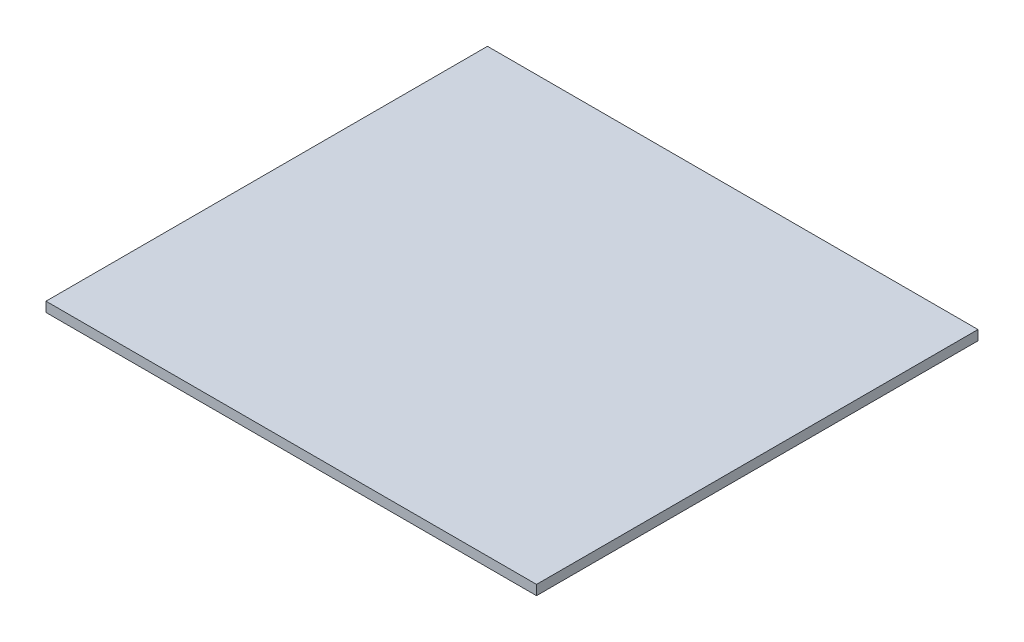
ISO-10303-21;
HEADER;
FILE_DESCRIPTION(('STEP AP214'),'2;1');
FILE_NAME('part.step','',(''),(''),'','','');
FILE_SCHEMA(('AUTOMOTIVE_DESIGN { 1 0 10303 214 1 1 1 1 }'));
ENDSEC;
DATA;
#1=APPLICATION_CONTEXT('core data for automotive mechanical design processes');
#2=APPLICATION_PROTOCOL_DEFINITION('international standard','automotive_design',2000,#1);
#3=PRODUCT_CONTEXT('',#1,'mechanical');
#4=PRODUCT('Part','Part','',(#3));
#5=PRODUCT_RELATED_PRODUCT_CATEGORY('part','',(#4));
#6=PRODUCT_DEFINITION_FORMATION('','',#4);
#7=PRODUCT_DEFINITION_CONTEXT('part definition',#1,'design');
#8=PRODUCT_DEFINITION('design','',#6,#7);
#9=PRODUCT_DEFINITION_SHAPE('','',#8);
#10=(LENGTH_UNIT() NAMED_UNIT(*) SI_UNIT(.MILLI.,.METRE.));
#11=(NAMED_UNIT(*) PLANE_ANGLE_UNIT() SI_UNIT($,.RADIAN.));
#12=(NAMED_UNIT(*) SI_UNIT($,.STERADIAN.) SOLID_ANGLE_UNIT());
#13=UNCERTAINTY_MEASURE_WITH_UNIT(LENGTH_MEASURE(1.E-05),#10,'distance_accuracy_value','');
#14=(GEOMETRIC_REPRESENTATION_CONTEXT(3) GLOBAL_UNCERTAINTY_ASSIGNED_CONTEXT((#13)) GLOBAL_UNIT_ASSIGNED_CONTEXT((#10,
#11,#12)) REPRESENTATION_CONTEXT('',''));
#15=CARTESIAN_POINT('',(0.,0.,0.));
#16=DIRECTION('',(0.,0.,1.));
#17=DIRECTION('',(1.,0.,0.));
#18=AXIS2_PLACEMENT_3D('',#15,#16,#17);
#19=CARTESIAN_POINT('',(0.,5.08,0.));
#20=DIRECTION('',(1.,0.,0.));
#21=DIRECTION('',(0.,0.,-1.));
#22=AXIS2_PLACEMENT_3D('',#19,#20,#21);
#23=PLANE('',#22);
#24=DIRECTION('',(0.,0.,1.));
#25=VECTOR('',#24,1.);
#26=CARTESIAN_POINT('',(0.,0.,0.));
#27=LINE('',#26,#25);
#28=CARTESIAN_POINT('',(0.,0.,-228.6));
#29=VERTEX_POINT('',#28);
#30=CARTESIAN_POINT('',(0.,0.,0.));
#31=VERTEX_POINT('',#30);
#32=EDGE_CURVE('E96',#29,#31,#27,.T.);
#33=ORIENTED_EDGE('',*,*,#32,.T.);
#34=DIRECTION('',(0.,-1.,0.));
#35=VECTOR('',#34,1.);
#36=CARTESIAN_POINT('',(0.,5.08,0.));
#37=LINE('',#36,#35);
#38=CARTESIAN_POINT('',(0.,5.08,0.));
#39=VERTEX_POINT('',#38);
#40=EDGE_CURVE('E11',#39,#31,#37,.T.);
#41=ORIENTED_EDGE('',*,*,#40,.F.);
#42=DIRECTION('',(0.,0.,1.));
#43=VECTOR('',#42,1.);
#44=CARTESIAN_POINT('',(0.,5.08,0.));
#45=LINE('',#44,#43);
#46=CARTESIAN_POINT('',(0.,5.08,-228.6));
#47=VERTEX_POINT('',#46);
#48=EDGE_CURVE('E84',#47,#39,#45,.T.);
#49=ORIENTED_EDGE('',*,*,#48,.F.);
#50=DIRECTION('',(0.,-1.,0.));
#51=VECTOR('',#50,1.);
#52=CARTESIAN_POINT('',(0.,5.08,-228.6));
#53=LINE('',#52,#51);
#54=EDGE_CURVE('E92',#47,#29,#53,.T.);
#55=ORIENTED_EDGE('',*,*,#54,.T.);
#56=EDGE_LOOP('',(#33,#41,#49,#55));
#57=FACE_BOUND('',#56,.T.);
#58=ADVANCED_FACE('F33',(#57),#23,.F.);
#59=CARTESIAN_POINT('',(0.,5.08,0.));
#60=DIRECTION('',(0.,0.,-1.));
#61=DIRECTION('',(-1.,0.,0.));
#62=AXIS2_PLACEMENT_3D('',#59,#60,#61);
#63=PLANE('',#62);
#64=DIRECTION('',(1.,0.,0.));
#65=VECTOR('',#64,1.);
#66=CARTESIAN_POINT('',(0.,0.,0.));
#67=LINE('',#66,#65);
#68=CARTESIAN_POINT('',(254.,0.,0.));
#69=VERTEX_POINT('',#68);
#70=EDGE_CURVE('E88',#31,#69,#67,.T.);
#71=ORIENTED_EDGE('',*,*,#70,.T.);
#72=DIRECTION('',(0.,-1.,0.));
#73=VECTOR('',#72,1.);
#74=CARTESIAN_POINT('',(254.,5.08,0.));
#75=LINE('',#74,#73);
#76=CARTESIAN_POINT('',(254.,5.08,0.));
#77=VERTEX_POINT('',#76);
#78=EDGE_CURVE('E41',#77,#69,#75,.T.);
#79=ORIENTED_EDGE('',*,*,#78,.F.);
#80=DIRECTION('',(1.,0.,0.));
#81=VECTOR('',#80,1.);
#82=CARTESIAN_POINT('',(0.,5.08,0.));
#83=LINE('',#82,#81);
#84=EDGE_CURVE('E79',#39,#77,#83,.T.);
#85=ORIENTED_EDGE('',*,*,#84,.F.);
#86=ORIENTED_EDGE('',*,*,#40,.T.);
#87=EDGE_LOOP('',(#71,#79,#85,#86));
#88=FACE_BOUND('',#87,.T.);
#89=ADVANCED_FACE('F87',(#88),#63,.F.);
#90=CARTESIAN_POINT('',(254.,5.08,0.));
#91=DIRECTION('',(-1.,0.,0.));
#92=DIRECTION('',(0.,0.,1.));
#93=AXIS2_PLACEMENT_3D('',#90,#91,#92);
#94=PLANE('',#93);
#95=DIRECTION('',(0.,0.,-1.));
#96=VECTOR('',#95,1.);
#97=CARTESIAN_POINT('',(254.,0.,0.));
#98=LINE('',#97,#96);
#99=CARTESIAN_POINT('',(254.,0.,-228.6));
#100=VERTEX_POINT('',#99);
#101=EDGE_CURVE('E66',#69,#100,#98,.T.);
#102=ORIENTED_EDGE('',*,*,#101,.T.);
#103=DIRECTION('',(0.,-1.,0.));
#104=VECTOR('',#103,1.);
#105=CARTESIAN_POINT('',(254.,5.08,-228.6));
#106=LINE('',#105,#104);
#107=CARTESIAN_POINT('',(254.,5.08,-228.6));
#108=VERTEX_POINT('',#107);
#109=EDGE_CURVE('E89',#108,#100,#106,.T.);
#110=ORIENTED_EDGE('',*,*,#109,.F.);
#111=DIRECTION('',(0.,0.,-1.));
#112=VECTOR('',#111,1.);
#113=CARTESIAN_POINT('',(254.,5.08,0.));
#114=LINE('',#113,#112);
#115=EDGE_CURVE('E82',#77,#108,#114,.T.);
#116=ORIENTED_EDGE('',*,*,#115,.F.);
#117=ORIENTED_EDGE('',*,*,#78,.T.);
#118=EDGE_LOOP('',(#102,#110,#116,#117));
#119=FACE_BOUND('',#118,.T.);
#120=ADVANCED_FACE('F90',(#119),#94,.F.);
#121=CARTESIAN_POINT('',(0.,5.08,-228.6));
#122=DIRECTION('',(0.,0.,1.));
#123=DIRECTION('',(1.,0.,0.));
#124=AXIS2_PLACEMENT_3D('',#121,#122,#123);
#125=PLANE('',#124);
#126=DIRECTION('',(-1.,0.,0.));
#127=VECTOR('',#126,1.);
#128=CARTESIAN_POINT('',(0.,0.,-228.6));
#129=LINE('',#128,#127);
#130=EDGE_CURVE('E72',#100,#29,#129,.T.);
#131=ORIENTED_EDGE('',*,*,#130,.T.);
#132=ORIENTED_EDGE('',*,*,#54,.F.);
#133=DIRECTION('',(-1.,0.,0.));
#134=VECTOR('',#133,1.);
#135=CARTESIAN_POINT('',(0.,5.08,-228.6));
#136=LINE('',#135,#134);
#137=EDGE_CURVE('E49',#108,#47,#136,.T.);
#138=ORIENTED_EDGE('',*,*,#137,.F.);
#139=ORIENTED_EDGE('',*,*,#109,.T.);
#140=EDGE_LOOP('',(#131,#132,#138,#139));
#141=FACE_BOUND('',#140,.T.);
#142=ADVANCED_FACE('F103',(#141),#125,.F.);
#143=CARTESIAN_POINT('',(0.,5.08,0.));
#144=DIRECTION('',(0.,-1.,0.));
#145=DIRECTION('',(0.,0.,-1.));
#146=AXIS2_PLACEMENT_3D('',#143,#144,#145);
#147=PLANE('',#146);
#148=ORIENTED_EDGE('',*,*,#48,.T.);
#149=ORIENTED_EDGE('',*,*,#84,.T.);
#150=ORIENTED_EDGE('',*,*,#115,.T.);
#151=ORIENTED_EDGE('',*,*,#137,.T.);
#152=EDGE_LOOP('',(#148,#149,#150,#151));
#153=FACE_BOUND('',#152,.T.);
#154=ADVANCED_FACE('F80',(#153),#147,.F.);
#155=CARTESIAN_POINT('',(0.,0.,0.));
#156=DIRECTION('',(0.,-1.,0.));
#157=DIRECTION('',(0.,0.,-1.));
#158=AXIS2_PLACEMENT_3D('',#155,#156,#157);
#159=PLANE('',#158);
#160=ORIENTED_EDGE('',*,*,#32,.F.);
#161=ORIENTED_EDGE('',*,*,#130,.F.);
#162=ORIENTED_EDGE('',*,*,#101,.F.);
#163=ORIENTED_EDGE('',*,*,#70,.F.);
#164=EDGE_LOOP('',(#160,#161,#162,#163));
#165=FACE_BOUND('',#164,.T.);
#166=ADVANCED_FACE('F106',(#165),#159,.T.);
#167=CLOSED_SHELL('',(#58,#89,#120,#142,#154,#166));
#168=MANIFOLD_SOLID_BREP('B2',#167);
#169=ADVANCED_BREP_SHAPE_REPRESENTATION('',(#18,#168),#14);
#170=SHAPE_DEFINITION_REPRESENTATION(#9,#169);
ENDSEC;
END-ISO-10303-21;
